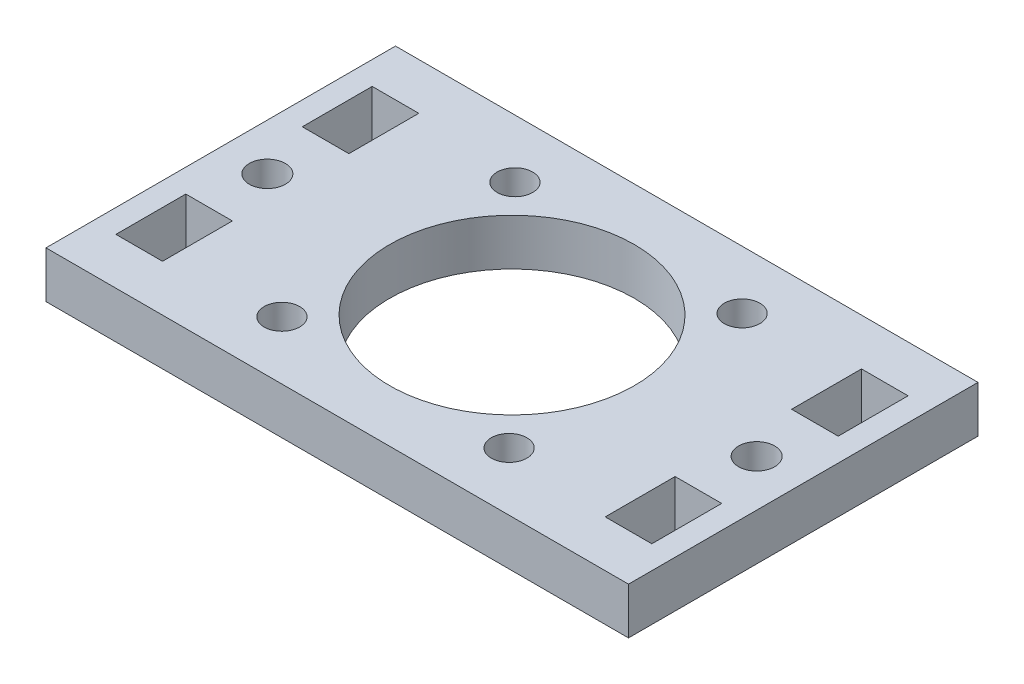
ISO-10303-21;
HEADER;
FILE_DESCRIPTION(('STEP AP214'),'2;1');
FILE_NAME('part.step','',(''),(''),'','','');
FILE_SCHEMA(('AUTOMOTIVE_DESIGN { 1 0 10303 214 1 1 1 1 }'));
ENDSEC;
DATA;
#1=APPLICATION_CONTEXT('core data for automotive mechanical design processes');
#2=APPLICATION_PROTOCOL_DEFINITION('international standard','automotive_design',2000,#1);
#3=PRODUCT_CONTEXT('',#1,'mechanical');
#4=PRODUCT('Part','Part','',(#3));
#5=PRODUCT_RELATED_PRODUCT_CATEGORY('part','',(#4));
#6=PRODUCT_DEFINITION_FORMATION('','',#4);
#7=PRODUCT_DEFINITION_CONTEXT('part definition',#1,'design');
#8=PRODUCT_DEFINITION('design','',#6,#7);
#9=PRODUCT_DEFINITION_SHAPE('','',#8);
#10=(LENGTH_UNIT() NAMED_UNIT(*) SI_UNIT(.MILLI.,.METRE.));
#11=(NAMED_UNIT(*) PLANE_ANGLE_UNIT() SI_UNIT($,.RADIAN.));
#12=(NAMED_UNIT(*) SI_UNIT($,.STERADIAN.) SOLID_ANGLE_UNIT());
#13=UNCERTAINTY_MEASURE_WITH_UNIT(LENGTH_MEASURE(1.E-05),#10,'distance_accuracy_value','');
#14=(GEOMETRIC_REPRESENTATION_CONTEXT(3) GLOBAL_UNCERTAINTY_ASSIGNED_CONTEXT((#13)) GLOBAL_UNIT_ASSIGNED_CONTEXT((#10,
#11,#12)) REPRESENTATION_CONTEXT('',''));
#15=CARTESIAN_POINT('',(0.,0.,0.));
#16=DIRECTION('',(0.,0.,1.));
#17=DIRECTION('',(1.,0.,0.));
#18=AXIS2_PLACEMENT_3D('',#15,#16,#17);
#19=CARTESIAN_POINT('',(25.,4.,15.));
#20=DIRECTION('',(-1.,0.,0.));
#21=DIRECTION('',(0.,0.,1.));
#22=AXIS2_PLACEMENT_3D('',#19,#20,#21);
#23=PLANE('',#22);
#24=DIRECTION('',(0.,0.,-1.));
#25=VECTOR('',#24,1.);
#26=CARTESIAN_POINT('',(25.,0.,15.));
#27=LINE('',#26,#25);
#28=CARTESIAN_POINT('',(25.,0.,15.));
#29=VERTEX_POINT('',#28);
#30=CARTESIAN_POINT('',(25.,0.,-15.));
#31=VERTEX_POINT('',#30);
#32=EDGE_CURVE('E298',#29,#31,#27,.T.);
#33=ORIENTED_EDGE('',*,*,#32,.T.);
#34=DIRECTION('',(0.,-1.,0.));
#35=VECTOR('',#34,1.);
#36=CARTESIAN_POINT('',(25.,4.,-15.));
#37=LINE('',#36,#35);
#38=CARTESIAN_POINT('',(25.,4.,-15.));
#39=VERTEX_POINT('',#38);
#40=EDGE_CURVE('E11',#39,#31,#37,.T.);
#41=ORIENTED_EDGE('',*,*,#40,.F.);
#42=DIRECTION('',(0.,0.,-1.));
#43=VECTOR('',#42,1.);
#44=CARTESIAN_POINT('',(25.,4.,15.));
#45=LINE('',#44,#43);
#46=CARTESIAN_POINT('',(25.,4.,15.));
#47=VERTEX_POINT('',#46);
#48=EDGE_CURVE('E305',#47,#39,#45,.T.);
#49=ORIENTED_EDGE('',*,*,#48,.F.);
#50=DIRECTION('',(0.,-1.,0.));
#51=VECTOR('',#50,1.);
#52=CARTESIAN_POINT('',(25.,4.,15.));
#53=LINE('',#52,#51);
#54=EDGE_CURVE('E315',#47,#29,#53,.T.);
#55=ORIENTED_EDGE('',*,*,#54,.T.);
#56=EDGE_LOOP('',(#33,#41,#49,#55));
#57=FACE_BOUND('',#56,.T.);
#58=ADVANCED_FACE('F32',(#57),#23,.F.);
#59=CARTESIAN_POINT('',(-25.,4.,-15.));
#60=DIRECTION('',(0.,0.,1.));
#61=DIRECTION('',(1.,0.,0.));
#62=AXIS2_PLACEMENT_3D('',#59,#60,#61);
#63=PLANE('',#62);
#64=DIRECTION('',(-1.,0.,0.));
#65=VECTOR('',#64,1.);
#66=CARTESIAN_POINT('',(-25.,0.,-15.));
#67=LINE('',#66,#65);
#68=CARTESIAN_POINT('',(-25.,0.,-15.));
#69=VERTEX_POINT('',#68);
#70=EDGE_CURVE('E318',#31,#69,#67,.T.);
#71=ORIENTED_EDGE('',*,*,#70,.T.);
#72=DIRECTION('',(0.,-1.,0.));
#73=VECTOR('',#72,1.);
#74=CARTESIAN_POINT('',(-25.,4.,-15.));
#75=LINE('',#74,#73);
#76=CARTESIAN_POINT('',(-25.,4.,-15.));
#77=VERTEX_POINT('',#76);
#78=EDGE_CURVE('E39',#77,#69,#75,.T.);
#79=ORIENTED_EDGE('',*,*,#78,.F.);
#80=DIRECTION('',(-1.,0.,0.));
#81=VECTOR('',#80,1.);
#82=CARTESIAN_POINT('',(-25.,4.,-15.));
#83=LINE('',#82,#81);
#84=EDGE_CURVE('E308',#39,#77,#83,.T.);
#85=ORIENTED_EDGE('',*,*,#84,.F.);
#86=ORIENTED_EDGE('',*,*,#40,.T.);
#87=EDGE_LOOP('',(#71,#79,#85,#86));
#88=FACE_BOUND('',#87,.T.);
#89=ADVANCED_FACE('F347',(#88),#63,.F.);
#90=CARTESIAN_POINT('',(-25.,4.,15.));
#91=DIRECTION('',(1.,0.,0.));
#92=DIRECTION('',(0.,0.,-1.));
#93=AXIS2_PLACEMENT_3D('',#90,#91,#92);
#94=PLANE('',#93);
#95=DIRECTION('',(0.,0.,1.));
#96=VECTOR('',#95,1.);
#97=CARTESIAN_POINT('',(-25.,0.,15.));
#98=LINE('',#97,#96);
#99=CARTESIAN_POINT('',(-25.,0.,15.));
#100=VERTEX_POINT('',#99);
#101=EDGE_CURVE('E320',#69,#100,#98,.T.);
#102=ORIENTED_EDGE('',*,*,#101,.T.);
#103=DIRECTION('',(0.,-1.,0.));
#104=VECTOR('',#103,1.);
#105=CARTESIAN_POINT('',(-25.,4.,15.));
#106=LINE('',#105,#104);
#107=CARTESIAN_POINT('',(-25.,4.,15.));
#108=VERTEX_POINT('',#107);
#109=EDGE_CURVE('E325',#108,#100,#106,.T.);
#110=ORIENTED_EDGE('',*,*,#109,.F.);
#111=DIRECTION('',(0.,0.,1.));
#112=VECTOR('',#111,1.);
#113=CARTESIAN_POINT('',(-25.,4.,15.));
#114=LINE('',#113,#112);
#115=EDGE_CURVE('E311',#77,#108,#114,.T.);
#116=ORIENTED_EDGE('',*,*,#115,.F.);
#117=ORIENTED_EDGE('',*,*,#78,.T.);
#118=EDGE_LOOP('',(#102,#110,#116,#117));
#119=FACE_BOUND('',#118,.T.);
#120=ADVANCED_FACE('F332',(#119),#94,.F.);
#121=CARTESIAN_POINT('',(-25.,4.,15.));
#122=DIRECTION('',(0.,0.,-1.));
#123=DIRECTION('',(-1.,0.,0.));
#124=AXIS2_PLACEMENT_3D('',#121,#122,#123);
#125=PLANE('',#124);
#126=DIRECTION('',(1.,0.,0.));
#127=VECTOR('',#126,1.);
#128=CARTESIAN_POINT('',(-25.,0.,15.));
#129=LINE('',#128,#127);
#130=EDGE_CURVE('E309',#100,#29,#129,.T.);
#131=ORIENTED_EDGE('',*,*,#130,.T.);
#132=ORIENTED_EDGE('',*,*,#54,.F.);
#133=DIRECTION('',(1.,0.,0.));
#134=VECTOR('',#133,1.);
#135=CARTESIAN_POINT('',(-25.,4.,15.));
#136=LINE('',#135,#134);
#137=EDGE_CURVE('E313',#108,#47,#136,.T.);
#138=ORIENTED_EDGE('',*,*,#137,.F.);
#139=ORIENTED_EDGE('',*,*,#109,.T.);
#140=EDGE_LOOP('',(#131,#132,#138,#139));
#141=FACE_BOUND('',#140,.T.);
#142=ADVANCED_FACE('F340',(#141),#125,.F.);
#143=CARTESIAN_POINT('',(0.,4.,0.));
#144=DIRECTION('',(0.,-1.,0.));
#145=DIRECTION('',(0.,0.,-1.));
#146=AXIS2_PLACEMENT_3D('',#143,#144,#145);
#147=PLANE('',#146);
#148=CARTESIAN_POINT('',(9.75,4.,10.));
#149=DIRECTION('',(0.,-1.,0.));
#150=DIRECTION('',(0.,0.,-1.));
#151=AXIS2_PLACEMENT_3D('',#148,#149,#150);
#152=CIRCLE('',#151,1.525);
#153=CARTESIAN_POINT('',(9.75,4.,8.475));
#154=VERTEX_POINT('',#153);
#155=EDGE_CURVE('E454',#154,#154,#152,.T.);
#156=ORIENTED_EDGE('',*,*,#155,.T.);
#157=EDGE_LOOP('',(#156));
#158=FACE_BOUND('',#157,.T.);
#159=CARTESIAN_POINT('',(9.75,4.,-10.));
#160=DIRECTION('',(0.,-1.,0.));
#161=DIRECTION('',(0.,0.,-1.));
#162=AXIS2_PLACEMENT_3D('',#159,#160,#161);
#163=CIRCLE('',#162,1.525);
#164=CARTESIAN_POINT('',(9.75,4.,-11.525));
#165=VERTEX_POINT('',#164);
#166=EDGE_CURVE('E462',#165,#165,#163,.T.);
#167=ORIENTED_EDGE('',*,*,#166,.T.);
#168=EDGE_LOOP('',(#167));
#169=FACE_BOUND('',#168,.T.);
#170=CARTESIAN_POINT('',(-9.75,4.,-10.));
#171=DIRECTION('',(0.,-1.,0.));
#172=DIRECTION('',(0.,0.,-1.));
#173=AXIS2_PLACEMENT_3D('',#170,#171,#172);
#174=CIRCLE('',#173,1.525);
#175=CARTESIAN_POINT('',(-9.75,4.,-11.525));
#176=VERTEX_POINT('',#175);
#177=EDGE_CURVE('E468',#176,#176,#174,.T.);
#178=ORIENTED_EDGE('',*,*,#177,.T.);
#179=EDGE_LOOP('',(#178));
#180=FACE_BOUND('',#179,.T.);
#181=CARTESIAN_POINT('',(-9.75,4.,10.));
#182=DIRECTION('',(0.,-1.,0.));
#183=DIRECTION('',(0.,0.,-1.));
#184=AXIS2_PLACEMENT_3D('',#181,#182,#183);
#185=CIRCLE('',#184,1.525);
#186=CARTESIAN_POINT('',(-9.75,4.,8.475));
#187=VERTEX_POINT('',#186);
#188=EDGE_CURVE('E474',#187,#187,#185,.T.);
#189=ORIENTED_EDGE('',*,*,#188,.T.);
#190=EDGE_LOOP('',(#189));
#191=FACE_BOUND('',#190,.T.);
#192=CARTESIAN_POINT('',(0.,4.,0.));
#193=DIRECTION('',(0.,-1.,0.));
#194=DIRECTION('',(0.,0.,-1.));
#195=AXIS2_PLACEMENT_3D('',#192,#193,#194);
#196=CIRCLE('',#195,10.5);
#197=CARTESIAN_POINT('',(0.,4.,-10.5));
#198=VERTEX_POINT('',#197);
#199=EDGE_CURVE('E480',#198,#198,#196,.T.);
#200=ORIENTED_EDGE('',*,*,#199,.T.);
#201=EDGE_LOOP('',(#200));
#202=FACE_BOUND('',#201,.T.);
#203=CARTESIAN_POINT('',(21.,4.,0.));
#204=DIRECTION('',(0.,1.,0.));
#205=DIRECTION('',(0.,0.,-1.));
#206=AXIS2_PLACEMENT_3D('',#203,#204,#205);
#207=CIRCLE('',#206,1.55);
#208=CARTESIAN_POINT('',(21.,4.,-1.55));
#209=VERTEX_POINT('',#208);
#210=EDGE_CURVE('E483',#209,#209,#207,.T.);
#211=ORIENTED_EDGE('',*,*,#210,.F.);
#212=EDGE_LOOP('',(#211));
#213=FACE_BOUND('',#212,.T.);
#214=CARTESIAN_POINT('',(-21.,4.,0.));
#215=DIRECTION('',(0.,1.,0.));
#216=DIRECTION('',(0.,0.,1.));
#217=AXIS2_PLACEMENT_3D('',#214,#215,#216);
#218=CIRCLE('',#217,1.55);
#219=CARTESIAN_POINT('',(-21.,4.,1.55));
#220=VERTEX_POINT('',#219);
#221=EDGE_CURVE('E192',#220,#220,#218,.T.);
#222=ORIENTED_EDGE('',*,*,#221,.F.);
#223=EDGE_LOOP('',(#222));
#224=FACE_BOUND('',#223,.T.);
#225=DIRECTION('',(0.,0.,1.));
#226=VECTOR('',#225,1.);
#227=CARTESIAN_POINT('',(19.,4.,-11.));
#228=LINE('',#227,#226);
#229=CARTESIAN_POINT('',(19.,4.,-11.));
#230=VERTEX_POINT('',#229);
#231=CARTESIAN_POINT('',(19.,4.,-5.));
#232=VERTEX_POINT('',#231);
#233=EDGE_CURVE('E198',#230,#232,#228,.T.);
#234=ORIENTED_EDGE('',*,*,#233,.F.);
#235=DIRECTION('',(-1.,0.,0.));
#236=VECTOR('',#235,1.);
#237=CARTESIAN_POINT('',(23.,4.,-11.));
#238=LINE('',#237,#236);
#239=CARTESIAN_POINT('',(23.,4.,-11.));
#240=VERTEX_POINT('',#239);
#241=EDGE_CURVE('E46',#240,#230,#238,.T.);
#242=ORIENTED_EDGE('',*,*,#241,.F.);
#243=DIRECTION('',(0.,0.,-1.));
#244=VECTOR('',#243,1.);
#245=CARTESIAN_POINT('',(23.,4.,-11.));
#246=LINE('',#245,#244);
#247=CARTESIAN_POINT('',(23.,4.,-5.));
#248=VERTEX_POINT('',#247);
#249=EDGE_CURVE('E186',#248,#240,#246,.T.);
#250=ORIENTED_EDGE('',*,*,#249,.F.);
#251=DIRECTION('',(1.,0.,0.));
#252=VECTOR('',#251,1.);
#253=CARTESIAN_POINT('',(23.,4.,-5.));
#254=LINE('',#253,#252);
#255=EDGE_CURVE('E189',#232,#248,#254,.T.);
#256=ORIENTED_EDGE('',*,*,#255,.F.);
#257=EDGE_LOOP('',(#234,#242,#250,#256));
#258=FACE_BOUND('',#257,.T.);
#259=DIRECTION('',(0.,0.,1.));
#260=VECTOR('',#259,1.);
#261=CARTESIAN_POINT('',(19.,4.,5.));
#262=LINE('',#261,#260);
#263=CARTESIAN_POINT('',(19.,4.,5.));
#264=VERTEX_POINT('',#263);
#265=CARTESIAN_POINT('',(19.,4.,11.));
#266=VERTEX_POINT('',#265);
#267=EDGE_CURVE('E224',#264,#266,#262,.T.);
#268=ORIENTED_EDGE('',*,*,#267,.F.);
#269=DIRECTION('',(-1.,0.,0.));
#270=VECTOR('',#269,1.);
#271=CARTESIAN_POINT('',(23.,4.,5.));
#272=LINE('',#271,#270);
#273=CARTESIAN_POINT('',(23.,4.,5.));
#274=VERTEX_POINT('',#273);
#275=EDGE_CURVE('E205',#274,#264,#272,.T.);
#276=ORIENTED_EDGE('',*,*,#275,.F.);
#277=DIRECTION('',(0.,0.,-1.));
#278=VECTOR('',#277,1.);
#279=CARTESIAN_POINT('',(23.,4.,5.));
#280=LINE('',#279,#278);
#281=CARTESIAN_POINT('',(23.,4.,11.));
#282=VERTEX_POINT('',#281);
#283=EDGE_CURVE('E213',#282,#274,#280,.T.);
#284=ORIENTED_EDGE('',*,*,#283,.F.);
#285=DIRECTION('',(1.,0.,0.));
#286=VECTOR('',#285,1.);
#287=CARTESIAN_POINT('',(23.,4.,11.));
#288=LINE('',#287,#286);
#289=EDGE_CURVE('E227',#266,#282,#288,.T.);
#290=ORIENTED_EDGE('',*,*,#289,.F.);
#291=EDGE_LOOP('',(#268,#276,#284,#290));
#292=FACE_BOUND('',#291,.T.);
#293=DIRECTION('',(1.,0.,0.));
#294=VECTOR('',#293,1.);
#295=CARTESIAN_POINT('',(-23.,4.,11.));
#296=LINE('',#295,#294);
#297=CARTESIAN_POINT('',(-23.,4.,11.));
#298=VERTEX_POINT('',#297);
#299=CARTESIAN_POINT('',(-19.,4.,11.));
#300=VERTEX_POINT('',#299);
#301=EDGE_CURVE('E256',#298,#300,#296,.T.);
#302=ORIENTED_EDGE('',*,*,#301,.F.);
#303=DIRECTION('',(0.,0.,1.));
#304=VECTOR('',#303,1.);
#305=CARTESIAN_POINT('',(-23.,4.,5.));
#306=LINE('',#305,#304);
#307=CARTESIAN_POINT('',(-23.,4.,5.));
#308=VERTEX_POINT('',#307);
#309=EDGE_CURVE('E234',#308,#298,#306,.T.);
#310=ORIENTED_EDGE('',*,*,#309,.F.);
#311=DIRECTION('',(-1.,0.,0.));
#312=VECTOR('',#311,1.);
#313=CARTESIAN_POINT('',(-23.,4.,5.));
#314=LINE('',#313,#312);
#315=CARTESIAN_POINT('',(-19.,4.,5.));
#316=VERTEX_POINT('',#315);
#317=EDGE_CURVE('E245',#316,#308,#314,.T.);
#318=ORIENTED_EDGE('',*,*,#317,.F.);
#319=DIRECTION('',(0.,0.,-1.));
#320=VECTOR('',#319,1.);
#321=CARTESIAN_POINT('',(-19.,4.,5.));
#322=LINE('',#321,#320);
#323=EDGE_CURVE('E259',#300,#316,#322,.T.);
#324=ORIENTED_EDGE('',*,*,#323,.F.);
#325=EDGE_LOOP('',(#302,#310,#318,#324));
#326=FACE_BOUND('',#325,.T.);
#327=DIRECTION('',(1.,0.,0.));
#328=VECTOR('',#327,1.);
#329=CARTESIAN_POINT('',(-23.,4.,-5.));
#330=LINE('',#329,#328);
#331=CARTESIAN_POINT('',(-23.,4.,-5.));
#332=VERTEX_POINT('',#331);
#333=CARTESIAN_POINT('',(-19.,4.,-5.));
#334=VERTEX_POINT('',#333);
#335=EDGE_CURVE('E288',#332,#334,#330,.T.);
#336=ORIENTED_EDGE('',*,*,#335,.F.);
#337=DIRECTION('',(0.,0.,1.));
#338=VECTOR('',#337,1.);
#339=CARTESIAN_POINT('',(-23.,4.,-11.));
#340=LINE('',#339,#338);
#341=CARTESIAN_POINT('',(-23.,4.,-11.));
#342=VERTEX_POINT('',#341);
#343=EDGE_CURVE('E266',#342,#332,#340,.T.);
#344=ORIENTED_EDGE('',*,*,#343,.F.);
#345=DIRECTION('',(-1.,0.,0.));
#346=VECTOR('',#345,1.);
#347=CARTESIAN_POINT('',(-23.,4.,-11.));
#348=LINE('',#347,#346);
#349=CARTESIAN_POINT('',(-19.,4.,-11.));
#350=VERTEX_POINT('',#349);
#351=EDGE_CURVE('E277',#350,#342,#348,.T.);
#352=ORIENTED_EDGE('',*,*,#351,.F.);
#353=DIRECTION('',(0.,0.,-1.));
#354=VECTOR('',#353,1.);
#355=CARTESIAN_POINT('',(-19.,4.,-11.));
#356=LINE('',#355,#354);
#357=EDGE_CURVE('E291',#334,#350,#356,.T.);
#358=ORIENTED_EDGE('',*,*,#357,.F.);
#359=EDGE_LOOP('',(#336,#344,#352,#358));
#360=FACE_BOUND('',#359,.T.);
#361=ORIENTED_EDGE('',*,*,#48,.T.);
#362=ORIENTED_EDGE('',*,*,#84,.T.);
#363=ORIENTED_EDGE('',*,*,#115,.T.);
#364=ORIENTED_EDGE('',*,*,#137,.T.);
#365=EDGE_LOOP('',(#361,#362,#363,#364));
#366=FACE_BOUND('',#365,.T.);
#367=ADVANCED_FACE('F346',(#158,#169,#180,#191,#202,#213,#224,#258,#292,#326,#360,#366),#147,.F.);
#368=CARTESIAN_POINT('',(0.,0.,0.));
#369=DIRECTION('',(0.,-1.,0.));
#370=DIRECTION('',(0.,0.,-1.));
#371=AXIS2_PLACEMENT_3D('',#368,#369,#370);
#372=PLANE('',#371);
#373=CARTESIAN_POINT('',(9.75,0.,10.));
#374=DIRECTION('',(0.,-1.,0.));
#375=DIRECTION('',(0.,0.,-1.));
#376=AXIS2_PLACEMENT_3D('',#373,#374,#375);
#377=CIRCLE('',#376,1.525);
#378=CARTESIAN_POINT('',(9.75,0.,8.475));
#379=VERTEX_POINT('',#378);
#380=EDGE_CURVE('E457',#379,#379,#377,.T.);
#381=ORIENTED_EDGE('',*,*,#380,.F.);
#382=EDGE_LOOP('',(#381));
#383=FACE_BOUND('',#382,.T.);
#384=CARTESIAN_POINT('',(9.75,0.,-10.));
#385=DIRECTION('',(0.,-1.,0.));
#386=DIRECTION('',(0.,0.,-1.));
#387=AXIS2_PLACEMENT_3D('',#384,#385,#386);
#388=CIRCLE('',#387,1.525);
#389=CARTESIAN_POINT('',(9.75,0.,-11.525));
#390=VERTEX_POINT('',#389);
#391=EDGE_CURVE('E459',#390,#390,#388,.T.);
#392=ORIENTED_EDGE('',*,*,#391,.F.);
#393=EDGE_LOOP('',(#392));
#394=FACE_BOUND('',#393,.T.);
#395=CARTESIAN_POINT('',(-9.75,0.,-10.));
#396=DIRECTION('',(0.,-1.,0.));
#397=DIRECTION('',(0.,0.,-1.));
#398=AXIS2_PLACEMENT_3D('',#395,#396,#397);
#399=CIRCLE('',#398,1.525);
#400=CARTESIAN_POINT('',(-9.75,0.,-11.525));
#401=VERTEX_POINT('',#400);
#402=EDGE_CURVE('E465',#401,#401,#399,.T.);
#403=ORIENTED_EDGE('',*,*,#402,.F.);
#404=EDGE_LOOP('',(#403));
#405=FACE_BOUND('',#404,.T.);
#406=CARTESIAN_POINT('',(-9.75,0.,10.));
#407=DIRECTION('',(0.,-1.,0.));
#408=DIRECTION('',(0.,0.,-1.));
#409=AXIS2_PLACEMENT_3D('',#406,#407,#408);
#410=CIRCLE('',#409,1.525);
#411=CARTESIAN_POINT('',(-9.75,0.,8.475));
#412=VERTEX_POINT('',#411);
#413=EDGE_CURVE('E471',#412,#412,#410,.T.);
#414=ORIENTED_EDGE('',*,*,#413,.F.);
#415=EDGE_LOOP('',(#414));
#416=FACE_BOUND('',#415,.T.);
#417=CARTESIAN_POINT('',(0.,0.,0.));
#418=DIRECTION('',(0.,-1.,0.));
#419=DIRECTION('',(0.,0.,-1.));
#420=AXIS2_PLACEMENT_3D('',#417,#418,#419);
#421=CIRCLE('',#420,10.5);
#422=CARTESIAN_POINT('',(0.,0.,-10.5));
#423=VERTEX_POINT('',#422);
#424=EDGE_CURVE('E477',#423,#423,#421,.T.);
#425=ORIENTED_EDGE('',*,*,#424,.F.);
#426=EDGE_LOOP('',(#425));
#427=FACE_BOUND('',#426,.T.);
#428=CARTESIAN_POINT('',(21.,0.,0.));
#429=DIRECTION('',(0.,1.,0.));
#430=DIRECTION('',(0.,0.,-1.));
#431=AXIS2_PLACEMENT_3D('',#428,#429,#430);
#432=CIRCLE('',#431,1.55);
#433=CARTESIAN_POINT('',(21.,0.,-1.55));
#434=VERTEX_POINT('',#433);
#435=EDGE_CURVE('E486',#434,#434,#432,.T.);
#436=ORIENTED_EDGE('',*,*,#435,.T.);
#437=EDGE_LOOP('',(#436));
#438=FACE_BOUND('',#437,.T.);
#439=CARTESIAN_POINT('',(-21.,0.,0.));
#440=DIRECTION('',(0.,1.,0.));
#441=DIRECTION('',(0.,0.,1.));
#442=AXIS2_PLACEMENT_3D('',#439,#440,#441);
#443=CIRCLE('',#442,1.55);
#444=CARTESIAN_POINT('',(-21.,0.,1.55));
#445=VERTEX_POINT('',#444);
#446=EDGE_CURVE('E199',#445,#445,#443,.T.);
#447=ORIENTED_EDGE('',*,*,#446,.T.);
#448=EDGE_LOOP('',(#447));
#449=FACE_BOUND('',#448,.T.);
#450=DIRECTION('',(-1.,0.,0.));
#451=VECTOR('',#450,1.);
#452=CARTESIAN_POINT('',(23.,0.,-11.));
#453=LINE('',#452,#451);
#454=CARTESIAN_POINT('',(23.,0.,-11.));
#455=VERTEX_POINT('',#454);
#456=CARTESIAN_POINT('',(19.,0.,-11.));
#457=VERTEX_POINT('',#456);
#458=EDGE_CURVE('E170',#455,#457,#453,.T.);
#459=ORIENTED_EDGE('',*,*,#458,.T.);
#460=DIRECTION('',(0.,0.,1.));
#461=VECTOR('',#460,1.);
#462=CARTESIAN_POINT('',(19.,0.,-11.));
#463=LINE('',#462,#461);
#464=CARTESIAN_POINT('',(19.,0.,-5.));
#465=VERTEX_POINT('',#464);
#466=EDGE_CURVE('E179',#457,#465,#463,.T.);
#467=ORIENTED_EDGE('',*,*,#466,.T.);
#468=DIRECTION('',(1.,0.,0.));
#469=VECTOR('',#468,1.);
#470=CARTESIAN_POINT('',(23.,0.,-5.));
#471=LINE('',#470,#469);
#472=CARTESIAN_POINT('',(23.,0.,-5.));
#473=VERTEX_POINT('',#472);
#474=EDGE_CURVE('E54',#465,#473,#471,.T.);
#475=ORIENTED_EDGE('',*,*,#474,.T.);
#476=DIRECTION('',(0.,0.,-1.));
#477=VECTOR('',#476,1.);
#478=CARTESIAN_POINT('',(23.,0.,-11.));
#479=LINE('',#478,#477);
#480=EDGE_CURVE('E176',#473,#455,#479,.T.);
#481=ORIENTED_EDGE('',*,*,#480,.T.);
#482=EDGE_LOOP('',(#459,#467,#475,#481));
#483=FACE_BOUND('',#482,.T.);
#484=DIRECTION('',(-1.,0.,0.));
#485=VECTOR('',#484,1.);
#486=CARTESIAN_POINT('',(23.,0.,5.));
#487=LINE('',#486,#485);
#488=CARTESIAN_POINT('',(23.,0.,5.));
#489=VERTEX_POINT('',#488);
#490=CARTESIAN_POINT('',(19.,0.,5.));
#491=VERTEX_POINT('',#490);
#492=EDGE_CURVE('E209',#489,#491,#487,.T.);
#493=ORIENTED_EDGE('',*,*,#492,.T.);
#494=DIRECTION('',(0.,0.,1.));
#495=VECTOR('',#494,1.);
#496=CARTESIAN_POINT('',(19.,0.,5.));
#497=LINE('',#496,#495);
#498=CARTESIAN_POINT('',(19.,0.,11.));
#499=VERTEX_POINT('',#498);
#500=EDGE_CURVE('E212',#491,#499,#497,.T.);
#501=ORIENTED_EDGE('',*,*,#500,.T.);
#502=DIRECTION('',(1.,0.,0.));
#503=VECTOR('',#502,1.);
#504=CARTESIAN_POINT('',(23.,0.,11.));
#505=LINE('',#504,#503);
#506=CARTESIAN_POINT('',(23.,0.,11.));
#507=VERTEX_POINT('',#506);
#508=EDGE_CURVE('E216',#499,#507,#505,.T.);
#509=ORIENTED_EDGE('',*,*,#508,.T.);
#510=DIRECTION('',(0.,0.,-1.));
#511=VECTOR('',#510,1.);
#512=CARTESIAN_POINT('',(23.,0.,5.));
#513=LINE('',#512,#511);
#514=EDGE_CURVE('E219',#507,#489,#513,.T.);
#515=ORIENTED_EDGE('',*,*,#514,.T.);
#516=EDGE_LOOP('',(#493,#501,#509,#515));
#517=FACE_BOUND('',#516,.T.);
#518=DIRECTION('',(0.,0.,1.));
#519=VECTOR('',#518,1.);
#520=CARTESIAN_POINT('',(-23.,0.,5.));
#521=LINE('',#520,#519);
#522=CARTESIAN_POINT('',(-23.,0.,5.));
#523=VERTEX_POINT('',#522);
#524=CARTESIAN_POINT('',(-23.,0.,11.));
#525=VERTEX_POINT('',#524);
#526=EDGE_CURVE('E241',#523,#525,#521,.T.);
#527=ORIENTED_EDGE('',*,*,#526,.T.);
#528=DIRECTION('',(1.,0.,0.));
#529=VECTOR('',#528,1.);
#530=CARTESIAN_POINT('',(-23.,0.,11.));
#531=LINE('',#530,#529);
#532=CARTESIAN_POINT('',(-19.,0.,11.));
#533=VERTEX_POINT('',#532);
#534=EDGE_CURVE('E244',#525,#533,#531,.T.);
#535=ORIENTED_EDGE('',*,*,#534,.T.);
#536=DIRECTION('',(0.,0.,-1.));
#537=VECTOR('',#536,1.);
#538=CARTESIAN_POINT('',(-19.,0.,5.));
#539=LINE('',#538,#537);
#540=CARTESIAN_POINT('',(-19.,0.,5.));
#541=VERTEX_POINT('',#540);
#542=EDGE_CURVE('E248',#533,#541,#539,.T.);
#543=ORIENTED_EDGE('',*,*,#542,.T.);
#544=DIRECTION('',(-1.,0.,0.));
#545=VECTOR('',#544,1.);
#546=CARTESIAN_POINT('',(-23.,0.,5.));
#547=LINE('',#546,#545);
#548=EDGE_CURVE('E251',#541,#523,#547,.T.);
#549=ORIENTED_EDGE('',*,*,#548,.T.);
#550=EDGE_LOOP('',(#527,#535,#543,#549));
#551=FACE_BOUND('',#550,.T.);
#552=DIRECTION('',(0.,0.,1.));
#553=VECTOR('',#552,1.);
#554=CARTESIAN_POINT('',(-23.,0.,-11.));
#555=LINE('',#554,#553);
#556=CARTESIAN_POINT('',(-23.,0.,-11.));
#557=VERTEX_POINT('',#556);
#558=CARTESIAN_POINT('',(-23.,0.,-5.));
#559=VERTEX_POINT('',#558);
#560=EDGE_CURVE('E273',#557,#559,#555,.T.);
#561=ORIENTED_EDGE('',*,*,#560,.T.);
#562=DIRECTION('',(1.,0.,0.));
#563=VECTOR('',#562,1.);
#564=CARTESIAN_POINT('',(-23.,0.,-5.));
#565=LINE('',#564,#563);
#566=CARTESIAN_POINT('',(-19.,0.,-5.));
#567=VERTEX_POINT('',#566);
#568=EDGE_CURVE('E276',#559,#567,#565,.T.);
#569=ORIENTED_EDGE('',*,*,#568,.T.);
#570=DIRECTION('',(0.,0.,-1.));
#571=VECTOR('',#570,1.);
#572=CARTESIAN_POINT('',(-19.,0.,-11.));
#573=LINE('',#572,#571);
#574=CARTESIAN_POINT('',(-19.,0.,-11.));
#575=VERTEX_POINT('',#574);
#576=EDGE_CURVE('E280',#567,#575,#573,.T.);
#577=ORIENTED_EDGE('',*,*,#576,.T.);
#578=DIRECTION('',(-1.,0.,0.));
#579=VECTOR('',#578,1.);
#580=CARTESIAN_POINT('',(-23.,0.,-11.));
#581=LINE('',#580,#579);
#582=EDGE_CURVE('E283',#575,#557,#581,.T.);
#583=ORIENTED_EDGE('',*,*,#582,.T.);
#584=EDGE_LOOP('',(#561,#569,#577,#583));
#585=FACE_BOUND('',#584,.T.);
#586=ORIENTED_EDGE('',*,*,#32,.F.);
#587=ORIENTED_EDGE('',*,*,#130,.F.);
#588=ORIENTED_EDGE('',*,*,#101,.F.);
#589=ORIENTED_EDGE('',*,*,#70,.F.);
#590=EDGE_LOOP('',(#586,#587,#588,#589));
#591=FACE_BOUND('',#590,.T.);
#592=ADVANCED_FACE('F183',(#383,#394,#405,#416,#427,#438,#449,#483,#517,#551,#585,#591),#372,.T.);
#593=CARTESIAN_POINT('',(-23.,0.,-11.));
#594=DIRECTION('',(-1.,0.,0.));
#595=DIRECTION('',(0.,0.,1.));
#596=AXIS2_PLACEMENT_3D('',#593,#594,#595);
#597=PLANE('',#596);
#598=ORIENTED_EDGE('',*,*,#343,.T.);
#599=DIRECTION('',(0.,1.,0.));
#600=VECTOR('',#599,1.);
#601=CARTESIAN_POINT('',(-23.,0.,-5.));
#602=LINE('',#601,#600);
#603=EDGE_CURVE('E286',#559,#332,#602,.T.);
#604=ORIENTED_EDGE('',*,*,#603,.F.);
#605=ORIENTED_EDGE('',*,*,#560,.F.);
#606=DIRECTION('',(0.,1.,0.));
#607=VECTOR('',#606,1.);
#608=CARTESIAN_POINT('',(-23.,0.,-11.));
#609=LINE('',#608,#607);
#610=EDGE_CURVE('E296',#557,#342,#609,.T.);
#611=ORIENTED_EDGE('',*,*,#610,.T.);
#612=EDGE_LOOP('',(#598,#604,#605,#611));
#613=FACE_BOUND('',#612,.T.);
#614=ADVANCED_FACE('F359',(#613),#597,.F.);
#615=CARTESIAN_POINT('',(-23.,0.,-11.));
#616=DIRECTION('',(0.,0.,-1.));
#617=DIRECTION('',(-1.,0.,0.));
#618=AXIS2_PLACEMENT_3D('',#615,#616,#617);
#619=PLANE('',#618);
#620=ORIENTED_EDGE('',*,*,#351,.T.);
#621=ORIENTED_EDGE('',*,*,#610,.F.);
#622=ORIENTED_EDGE('',*,*,#582,.F.);
#623=DIRECTION('',(0.,1.,0.));
#624=VECTOR('',#623,1.);
#625=CARTESIAN_POINT('',(-19.,0.,-11.));
#626=LINE('',#625,#624);
#627=EDGE_CURVE('E299',#575,#350,#626,.T.);
#628=ORIENTED_EDGE('',*,*,#627,.T.);
#629=EDGE_LOOP('',(#620,#621,#622,#628));
#630=FACE_BOUND('',#629,.T.);
#631=ADVANCED_FACE('F366',(#630),#619,.F.);
#632=CARTESIAN_POINT('',(-19.,0.,-11.));
#633=DIRECTION('',(1.,0.,0.));
#634=DIRECTION('',(0.,0.,-1.));
#635=AXIS2_PLACEMENT_3D('',#632,#633,#634);
#636=PLANE('',#635);
#637=ORIENTED_EDGE('',*,*,#357,.T.);
#638=ORIENTED_EDGE('',*,*,#627,.F.);
#639=ORIENTED_EDGE('',*,*,#576,.F.);
#640=DIRECTION('',(0.,1.,0.));
#641=VECTOR('',#640,1.);
#642=CARTESIAN_POINT('',(-19.,0.,-5.));
#643=LINE('',#642,#641);
#644=EDGE_CURVE('E301',#567,#334,#643,.T.);
#645=ORIENTED_EDGE('',*,*,#644,.T.);
#646=EDGE_LOOP('',(#637,#638,#639,#645));
#647=FACE_BOUND('',#646,.T.);
#648=ADVANCED_FACE('F372',(#647),#636,.F.);
#649=CARTESIAN_POINT('',(-23.,0.,-5.));
#650=DIRECTION('',(0.,0.,1.));
#651=DIRECTION('',(1.,0.,0.));
#652=AXIS2_PLACEMENT_3D('',#649,#650,#651);
#653=PLANE('',#652);
#654=ORIENTED_EDGE('',*,*,#335,.T.);
#655=ORIENTED_EDGE('',*,*,#644,.F.);
#656=ORIENTED_EDGE('',*,*,#568,.F.);
#657=ORIENTED_EDGE('',*,*,#603,.T.);
#658=EDGE_LOOP('',(#654,#655,#656,#657));
#659=FACE_BOUND('',#658,.T.);
#660=ADVANCED_FACE('F368',(#659),#653,.F.);
#661=CARTESIAN_POINT('',(-23.,0.,5.));
#662=DIRECTION('',(-1.,0.,0.));
#663=DIRECTION('',(0.,0.,1.));
#664=AXIS2_PLACEMENT_3D('',#661,#662,#663);
#665=PLANE('',#664);
#666=ORIENTED_EDGE('',*,*,#309,.T.);
#667=DIRECTION('',(0.,1.,0.));
#668=VECTOR('',#667,1.);
#669=CARTESIAN_POINT('',(-23.,0.,11.));
#670=LINE('',#669,#668);
#671=EDGE_CURVE('E254',#525,#298,#670,.T.);
#672=ORIENTED_EDGE('',*,*,#671,.F.);
#673=ORIENTED_EDGE('',*,*,#526,.F.);
#674=DIRECTION('',(0.,1.,0.));
#675=VECTOR('',#674,1.);
#676=CARTESIAN_POINT('',(-23.,0.,5.));
#677=LINE('',#676,#675);
#678=EDGE_CURVE('E264',#523,#308,#677,.T.);
#679=ORIENTED_EDGE('',*,*,#678,.T.);
#680=EDGE_LOOP('',(#666,#672,#673,#679));
#681=FACE_BOUND('',#680,.T.);
#682=ADVANCED_FACE('F371',(#681),#665,.F.);
#683=CARTESIAN_POINT('',(-23.,0.,5.));
#684=DIRECTION('',(0.,0.,-1.));
#685=DIRECTION('',(-1.,0.,0.));
#686=AXIS2_PLACEMENT_3D('',#683,#684,#685);
#687=PLANE('',#686);
#688=ORIENTED_EDGE('',*,*,#317,.T.);
#689=ORIENTED_EDGE('',*,*,#678,.F.);
#690=ORIENTED_EDGE('',*,*,#548,.F.);
#691=DIRECTION('',(0.,1.,0.));
#692=VECTOR('',#691,1.);
#693=CARTESIAN_POINT('',(-19.,0.,5.));
#694=LINE('',#693,#692);
#695=EDGE_CURVE('E267',#541,#316,#694,.T.);
#696=ORIENTED_EDGE('',*,*,#695,.T.);
#697=EDGE_LOOP('',(#688,#689,#690,#696));
#698=FACE_BOUND('',#697,.T.);
#699=ADVANCED_FACE('F382',(#698),#687,.F.);
#700=CARTESIAN_POINT('',(-19.,0.,5.));
#701=DIRECTION('',(1.,0.,0.));
#702=DIRECTION('',(0.,0.,-1.));
#703=AXIS2_PLACEMENT_3D('',#700,#701,#702);
#704=PLANE('',#703);
#705=ORIENTED_EDGE('',*,*,#323,.T.);
#706=ORIENTED_EDGE('',*,*,#695,.F.);
#707=ORIENTED_EDGE('',*,*,#542,.F.);
#708=DIRECTION('',(0.,1.,0.));
#709=VECTOR('',#708,1.);
#710=CARTESIAN_POINT('',(-19.,0.,11.));
#711=LINE('',#710,#709);
#712=EDGE_CURVE('E269',#533,#300,#711,.T.);
#713=ORIENTED_EDGE('',*,*,#712,.T.);
#714=EDGE_LOOP('',(#705,#706,#707,#713));
#715=FACE_BOUND('',#714,.T.);
#716=ADVANCED_FACE('F388',(#715),#704,.F.);
#717=CARTESIAN_POINT('',(-23.,0.,11.));
#718=DIRECTION('',(0.,0.,1.));
#719=DIRECTION('',(1.,0.,0.));
#720=AXIS2_PLACEMENT_3D('',#717,#718,#719);
#721=PLANE('',#720);
#722=ORIENTED_EDGE('',*,*,#301,.T.);
#723=ORIENTED_EDGE('',*,*,#712,.F.);
#724=ORIENTED_EDGE('',*,*,#534,.F.);
#725=ORIENTED_EDGE('',*,*,#671,.T.);
#726=EDGE_LOOP('',(#722,#723,#724,#725));
#727=FACE_BOUND('',#726,.T.);
#728=ADVANCED_FACE('F384',(#727),#721,.F.);
#729=CARTESIAN_POINT('',(23.,0.,5.));
#730=DIRECTION('',(0.,0.,-1.));
#731=DIRECTION('',(-1.,0.,0.));
#732=AXIS2_PLACEMENT_3D('',#729,#730,#731);
#733=PLANE('',#732);
#734=ORIENTED_EDGE('',*,*,#275,.T.);
#735=DIRECTION('',(0.,1.,0.));
#736=VECTOR('',#735,1.);
#737=CARTESIAN_POINT('',(19.,0.,5.));
#738=LINE('',#737,#736);
#739=EDGE_CURVE('E222',#491,#264,#738,.T.);
#740=ORIENTED_EDGE('',*,*,#739,.F.);
#741=ORIENTED_EDGE('',*,*,#492,.F.);
#742=DIRECTION('',(0.,1.,0.));
#743=VECTOR('',#742,1.);
#744=CARTESIAN_POINT('',(23.,0.,5.));
#745=LINE('',#744,#743);
#746=EDGE_CURVE('E232',#489,#274,#745,.T.);
#747=ORIENTED_EDGE('',*,*,#746,.T.);
#748=EDGE_LOOP('',(#734,#740,#741,#747));
#749=FACE_BOUND('',#748,.T.);
#750=ADVANCED_FACE('F387',(#749),#733,.F.);
#751=CARTESIAN_POINT('',(23.,0.,5.));
#752=DIRECTION('',(1.,0.,0.));
#753=DIRECTION('',(0.,0.,-1.));
#754=AXIS2_PLACEMENT_3D('',#751,#752,#753);
#755=PLANE('',#754);
#756=ORIENTED_EDGE('',*,*,#283,.T.);
#757=ORIENTED_EDGE('',*,*,#746,.F.);
#758=ORIENTED_EDGE('',*,*,#514,.F.);
#759=DIRECTION('',(0.,1.,0.));
#760=VECTOR('',#759,1.);
#761=CARTESIAN_POINT('',(23.,0.,11.));
#762=LINE('',#761,#760);
#763=EDGE_CURVE('E235',#507,#282,#762,.T.);
#764=ORIENTED_EDGE('',*,*,#763,.T.);
#765=EDGE_LOOP('',(#756,#757,#758,#764));
#766=FACE_BOUND('',#765,.T.);
#767=ADVANCED_FACE('F398',(#766),#755,.F.);
#768=CARTESIAN_POINT('',(23.,0.,11.));
#769=DIRECTION('',(0.,0.,1.));
#770=DIRECTION('',(1.,0.,0.));
#771=AXIS2_PLACEMENT_3D('',#768,#769,#770);
#772=PLANE('',#771);
#773=ORIENTED_EDGE('',*,*,#289,.T.);
#774=ORIENTED_EDGE('',*,*,#763,.F.);
#775=ORIENTED_EDGE('',*,*,#508,.F.);
#776=DIRECTION('',(0.,1.,0.));
#777=VECTOR('',#776,1.);
#778=CARTESIAN_POINT('',(19.,0.,11.));
#779=LINE('',#778,#777);
#780=EDGE_CURVE('E237',#499,#266,#779,.T.);
#781=ORIENTED_EDGE('',*,*,#780,.T.);
#782=EDGE_LOOP('',(#773,#774,#775,#781));
#783=FACE_BOUND('',#782,.T.);
#784=ADVANCED_FACE('F403',(#783),#772,.F.);
#785=CARTESIAN_POINT('',(19.,0.,5.));
#786=DIRECTION('',(-1.,0.,0.));
#787=DIRECTION('',(0.,0.,1.));
#788=AXIS2_PLACEMENT_3D('',#785,#786,#787);
#789=PLANE('',#788);
#790=ORIENTED_EDGE('',*,*,#267,.T.);
#791=ORIENTED_EDGE('',*,*,#780,.F.);
#792=ORIENTED_EDGE('',*,*,#500,.F.);
#793=ORIENTED_EDGE('',*,*,#739,.T.);
#794=EDGE_LOOP('',(#790,#791,#792,#793));
#795=FACE_BOUND('',#794,.T.);
#796=ADVANCED_FACE('F400',(#795),#789,.F.);
#797=CARTESIAN_POINT('',(23.,0.,-11.));
#798=DIRECTION('',(0.,0.,-1.));
#799=DIRECTION('',(-1.,0.,0.));
#800=AXIS2_PLACEMENT_3D('',#797,#798,#799);
#801=PLANE('',#800);
#802=ORIENTED_EDGE('',*,*,#241,.T.);
#803=DIRECTION('',(0.,1.,0.));
#804=VECTOR('',#803,1.);
#805=CARTESIAN_POINT('',(19.,0.,-11.));
#806=LINE('',#805,#804);
#807=EDGE_CURVE('E166',#457,#230,#806,.T.);
#808=ORIENTED_EDGE('',*,*,#807,.F.);
#809=ORIENTED_EDGE('',*,*,#458,.F.);
#810=DIRECTION('',(0.,1.,0.));
#811=VECTOR('',#810,1.);
#812=CARTESIAN_POINT('',(23.,0.,-11.));
#813=LINE('',#812,#811);
#814=EDGE_CURVE('E203',#455,#240,#813,.T.);
#815=ORIENTED_EDGE('',*,*,#814,.T.);
#816=EDGE_LOOP('',(#802,#808,#809,#815));
#817=FACE_BOUND('',#816,.T.);
#818=ADVANCED_FACE('F168',(#817),#801,.F.);
#819=CARTESIAN_POINT('',(23.,0.,-11.));
#820=DIRECTION('',(1.,0.,0.));
#821=DIRECTION('',(0.,0.,-1.));
#822=AXIS2_PLACEMENT_3D('',#819,#820,#821);
#823=PLANE('',#822);
#824=ORIENTED_EDGE('',*,*,#249,.T.);
#825=ORIENTED_EDGE('',*,*,#814,.F.);
#826=ORIENTED_EDGE('',*,*,#480,.F.);
#827=DIRECTION('',(0.,1.,0.));
#828=VECTOR('',#827,1.);
#829=CARTESIAN_POINT('',(23.,0.,-5.));
#830=LINE('',#829,#828);
#831=EDGE_CURVE('E206',#473,#248,#830,.T.);
#832=ORIENTED_EDGE('',*,*,#831,.T.);
#833=EDGE_LOOP('',(#824,#825,#826,#832));
#834=FACE_BOUND('',#833,.T.);
#835=ADVANCED_FACE('F413',(#834),#823,.F.);
#836=CARTESIAN_POINT('',(23.,0.,-5.));
#837=DIRECTION('',(0.,0.,1.));
#838=DIRECTION('',(1.,0.,0.));
#839=AXIS2_PLACEMENT_3D('',#836,#837,#838);
#840=PLANE('',#839);
#841=ORIENTED_EDGE('',*,*,#255,.T.);
#842=ORIENTED_EDGE('',*,*,#831,.F.);
#843=ORIENTED_EDGE('',*,*,#474,.F.);
#844=DIRECTION('',(0.,1.,0.));
#845=VECTOR('',#844,1.);
#846=CARTESIAN_POINT('',(19.,0.,-5.));
#847=LINE('',#846,#845);
#848=EDGE_CURVE('E175',#465,#232,#847,.T.);
#849=ORIENTED_EDGE('',*,*,#848,.T.);
#850=EDGE_LOOP('',(#841,#842,#843,#849));
#851=FACE_BOUND('',#850,.T.);
#852=ADVANCED_FACE('F417',(#851),#840,.F.);
#853=CARTESIAN_POINT('',(19.,0.,-11.));
#854=DIRECTION('',(-1.,0.,0.));
#855=DIRECTION('',(0.,0.,1.));
#856=AXIS2_PLACEMENT_3D('',#853,#854,#855);
#857=PLANE('',#856);
#858=ORIENTED_EDGE('',*,*,#233,.T.);
#859=ORIENTED_EDGE('',*,*,#848,.F.);
#860=ORIENTED_EDGE('',*,*,#466,.F.);
#861=ORIENTED_EDGE('',*,*,#807,.T.);
#862=EDGE_LOOP('',(#858,#859,#860,#861));
#863=FACE_BOUND('',#862,.T.);
#864=ADVANCED_FACE('F180',(#863),#857,.F.);
#865=CARTESIAN_POINT('',(-21.,0.,0.));
#866=DIRECTION('',(0.,1.,0.));
#867=DIRECTION('',(0.,0.,1.));
#868=AXIS2_PLACEMENT_3D('',#865,#866,#867);
#869=CYLINDRICAL_SURFACE('',#868,1.55);
#870=ORIENTED_EDGE('',*,*,#446,.F.);
#871=EDGE_LOOP('',(#870));
#872=FACE_BOUND('',#871,.T.);
#873=ORIENTED_EDGE('',*,*,#221,.T.);
#874=EDGE_LOOP('',(#873));
#875=FACE_BOUND('',#874,.T.);
#876=ADVANCED_FACE('F416',(#872,#875),#869,.F.);
#877=CARTESIAN_POINT('',(21.,0.,0.));
#878=DIRECTION('',(0.,1.,0.));
#879=DIRECTION('',(0.,0.,1.));
#880=AXIS2_PLACEMENT_3D('',#877,#878,#879);
#881=CYLINDRICAL_SURFACE('',#880,1.55);
#882=ORIENTED_EDGE('',*,*,#435,.F.);
#883=EDGE_LOOP('',(#882));
#884=FACE_BOUND('',#883,.T.);
#885=ORIENTED_EDGE('',*,*,#210,.T.);
#886=EDGE_LOOP('',(#885));
#887=FACE_BOUND('',#886,.T.);
#888=ADVANCED_FACE('F425',(#884,#887),#881,.F.);
#889=CARTESIAN_POINT('',(0.,4.,0.));
#890=DIRECTION('',(0.,-1.,0.));
#891=DIRECTION('',(0.,0.,-1.));
#892=AXIS2_PLACEMENT_3D('',#889,#890,#891);
#893=CYLINDRICAL_SURFACE('',#892,10.5);
#894=ORIENTED_EDGE('',*,*,#199,.F.);
#895=EDGE_LOOP('',(#894));
#896=FACE_BOUND('',#895,.T.);
#897=ORIENTED_EDGE('',*,*,#424,.T.);
#898=EDGE_LOOP('',(#897));
#899=FACE_BOUND('',#898,.T.);
#900=ADVANCED_FACE('F429',(#896,#899),#893,.F.);
#901=CARTESIAN_POINT('',(-9.75,4.,10.));
#902=DIRECTION('',(0.,-1.,0.));
#903=DIRECTION('',(0.,0.,-1.));
#904=AXIS2_PLACEMENT_3D('',#901,#902,#903);
#905=CYLINDRICAL_SURFACE('',#904,1.525);
#906=ORIENTED_EDGE('',*,*,#188,.F.);
#907=EDGE_LOOP('',(#906));
#908=FACE_BOUND('',#907,.T.);
#909=ORIENTED_EDGE('',*,*,#413,.T.);
#910=EDGE_LOOP('',(#909));
#911=FACE_BOUND('',#910,.T.);
#912=ADVANCED_FACE('F433',(#908,#911),#905,.F.);
#913=CARTESIAN_POINT('',(-9.75,4.,-10.));
#914=DIRECTION('',(0.,-1.,0.));
#915=DIRECTION('',(0.,0.,-1.));
#916=AXIS2_PLACEMENT_3D('',#913,#914,#915);
#917=CYLINDRICAL_SURFACE('',#916,1.525);
#918=ORIENTED_EDGE('',*,*,#177,.F.);
#919=EDGE_LOOP('',(#918));
#920=FACE_BOUND('',#919,.T.);
#921=ORIENTED_EDGE('',*,*,#402,.T.);
#922=EDGE_LOOP('',(#921));
#923=FACE_BOUND('',#922,.T.);
#924=ADVANCED_FACE('F437',(#920,#923),#917,.F.);
#925=CARTESIAN_POINT('',(9.75,4.,-10.));
#926=DIRECTION('',(0.,-1.,0.));
#927=DIRECTION('',(0.,0.,-1.));
#928=AXIS2_PLACEMENT_3D('',#925,#926,#927);
#929=CYLINDRICAL_SURFACE('',#928,1.525);
#930=ORIENTED_EDGE('',*,*,#166,.F.);
#931=EDGE_LOOP('',(#930));
#932=FACE_BOUND('',#931,.T.);
#933=ORIENTED_EDGE('',*,*,#391,.T.);
#934=EDGE_LOOP('',(#933));
#935=FACE_BOUND('',#934,.T.);
#936=ADVANCED_FACE('F441',(#932,#935),#929,.F.);
#937=CARTESIAN_POINT('',(9.75,4.,10.));
#938=DIRECTION('',(0.,-1.,0.));
#939=DIRECTION('',(0.,0.,-1.));
#940=AXIS2_PLACEMENT_3D('',#937,#938,#939);
#941=CYLINDRICAL_SURFACE('',#940,1.525);
#942=ORIENTED_EDGE('',*,*,#155,.F.);
#943=EDGE_LOOP('',(#942));
#944=FACE_BOUND('',#943,.T.);
#945=ORIENTED_EDGE('',*,*,#380,.T.);
#946=EDGE_LOOP('',(#945));
#947=FACE_BOUND('',#946,.T.);
#948=ADVANCED_FACE('F445',(#944,#947),#941,.F.);
#949=CLOSED_SHELL('',(#58,#89,#120,#142,#367,#592,#614,#631,#648,#660,#682,#699,#716,#728,#750,
#767,#784,#796,#818,#835,#852,#864,#876,#888,#900,#912,#924,#936,#948));
#950=MANIFOLD_SOLID_BREP('B2',#949);
#951=ADVANCED_BREP_SHAPE_REPRESENTATION('',(#18,#950),#14);
#952=SHAPE_DEFINITION_REPRESENTATION(#9,#951);
ENDSEC;
END-ISO-10303-21;
